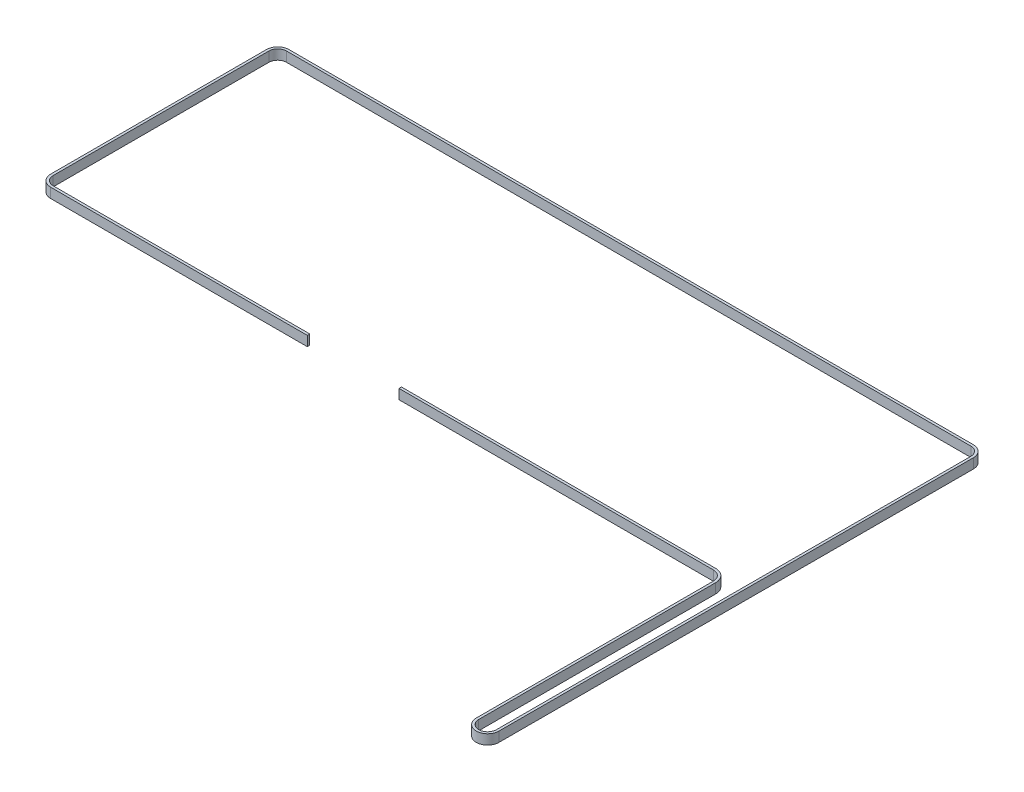
ISO-10303-21;
HEADER;
FILE_DESCRIPTION(('STEP AP214'),'2;1');
FILE_NAME('part.step','',(''),(''),'','','');
FILE_SCHEMA(('AUTOMOTIVE_DESIGN { 1 0 10303 214 1 1 1 1 }'));
ENDSEC;
DATA;
#1=APPLICATION_CONTEXT('core data for automotive mechanical design processes');
#2=APPLICATION_PROTOCOL_DEFINITION('international standard','automotive_design',2000,#1);
#3=PRODUCT_CONTEXT('',#1,'mechanical');
#4=PRODUCT('Part','Part','',(#3));
#5=PRODUCT_RELATED_PRODUCT_CATEGORY('part','',(#4));
#6=PRODUCT_DEFINITION_FORMATION('','',#4);
#7=PRODUCT_DEFINITION_CONTEXT('part definition',#1,'design');
#8=PRODUCT_DEFINITION('design','',#6,#7);
#9=PRODUCT_DEFINITION_SHAPE('','',#8);
#10=(LENGTH_UNIT() NAMED_UNIT(*) SI_UNIT(.MILLI.,.METRE.));
#11=(NAMED_UNIT(*) PLANE_ANGLE_UNIT() SI_UNIT($,.RADIAN.));
#12=(NAMED_UNIT(*) SI_UNIT($,.STERADIAN.) SOLID_ANGLE_UNIT());
#13=UNCERTAINTY_MEASURE_WITH_UNIT(LENGTH_MEASURE(1.E-05),#10,'distance_accuracy_value','');
#14=(GEOMETRIC_REPRESENTATION_CONTEXT(3) GLOBAL_UNCERTAINTY_ASSIGNED_CONTEXT((#13)) GLOBAL_UNIT_ASSIGNED_CONTEXT((#10,
#11,#12)) REPRESENTATION_CONTEXT('',''));
#15=CARTESIAN_POINT('',(0.,0.,0.));
#16=DIRECTION('',(0.,0.,1.));
#17=DIRECTION('',(1.,0.,0.));
#18=AXIS2_PLACEMENT_3D('',#15,#16,#17);
#19=CARTESIAN_POINT('',(195.6,315.,-15.5073370108978));
#20=DIRECTION('',(0.,1.,0.));
#21=DIRECTION('',(0.,0.,1.));
#22=AXIS2_PLACEMENT_3D('',#19,#20,#21);
#23=CYLINDRICAL_SURFACE('',#22,7.5);
#24=CARTESIAN_POINT('',(195.6,321.,-15.5073370108978));
#25=DIRECTION('',(0.,1.,0.));
#26=DIRECTION('',(0.,0.,1.));
#27=AXIS2_PLACEMENT_3D('',#24,#25,#26);
#28=CIRCLE('',#27,7.5);
#29=CARTESIAN_POINT('',(203.1,321.,-15.5073370108978));
#30=VERTEX_POINT('',#29);
#31=CARTESIAN_POINT('',(195.6,321.,-23.0073370108978));
#32=VERTEX_POINT('',#31);
#33=EDGE_CURVE('E230',#30,#32,#28,.T.);
#34=ORIENTED_EDGE('',*,*,#33,.F.);
#35=DIRECTION('',(0.,1.,0.));
#36=VECTOR('',#35,1.);
#37=CARTESIAN_POINT('',(203.1,315.,-15.5073370108978));
#38=LINE('',#37,#36);
#39=CARTESIAN_POINT('',(203.1,315.,-15.5073370108978));
#40=VERTEX_POINT('',#39);
#41=EDGE_CURVE('E11',#40,#30,#38,.T.);
#42=ORIENTED_EDGE('',*,*,#41,.F.);
#43=CARTESIAN_POINT('',(195.6,315.,-15.5073370108978));
#44=DIRECTION('',(0.,1.,0.));
#45=DIRECTION('',(0.,0.,1.));
#46=AXIS2_PLACEMENT_3D('',#43,#44,#45);
#47=CIRCLE('',#46,7.5);
#48=CARTESIAN_POINT('',(195.6,315.,-23.0073370108978));
#49=VERTEX_POINT('',#48);
#50=EDGE_CURVE('E298',#40,#49,#47,.T.);
#51=ORIENTED_EDGE('',*,*,#50,.T.);
#52=DIRECTION('',(0.,1.,0.));
#53=VECTOR('',#52,1.);
#54=CARTESIAN_POINT('',(195.6,315.,-23.0073370108978));
#55=LINE('',#54,#53);
#56=EDGE_CURVE('E40',#49,#32,#55,.T.);
#57=ORIENTED_EDGE('',*,*,#56,.T.);
#58=EDGE_LOOP('',(#34,#42,#51,#57));
#59=FACE_BOUND('',#58,.T.);
#60=ADVANCED_FACE('F37',(#59),#23,.T.);
#61=CARTESIAN_POINT('',(203.1,315.,129.));
#62=DIRECTION('',(1.,0.,0.));
#63=DIRECTION('',(0.,0.,-1.));
#64=AXIS2_PLACEMENT_3D('',#61,#62,#63);
#65=PLANE('',#64);
#66=DIRECTION('',(0.,0.,-1.));
#67=VECTOR('',#66,1.);
#68=CARTESIAN_POINT('',(203.1,321.,129.));
#69=LINE('',#68,#67);
#70=CARTESIAN_POINT('',(203.1,321.,129.));
#71=VERTEX_POINT('',#70);
#72=EDGE_CURVE('E296',#71,#30,#69,.T.);
#73=ORIENTED_EDGE('',*,*,#72,.F.);
#74=DIRECTION('',(0.,1.,0.));
#75=VECTOR('',#74,1.);
#76=CARTESIAN_POINT('',(203.1,315.,129.));
#77=LINE('',#76,#75);
#78=CARTESIAN_POINT('',(203.1,315.,129.));
#79=VERTEX_POINT('',#78);
#80=EDGE_CURVE('E46',#79,#71,#77,.T.);
#81=ORIENTED_EDGE('',*,*,#80,.F.);
#82=DIRECTION('',(0.,0.,-1.));
#83=VECTOR('',#82,1.);
#84=CARTESIAN_POINT('',(203.1,315.,129.));
#85=LINE('',#84,#83);
#86=EDGE_CURVE('E220',#79,#40,#85,.T.);
#87=ORIENTED_EDGE('',*,*,#86,.T.);
#88=ORIENTED_EDGE('',*,*,#41,.T.);
#89=EDGE_LOOP('',(#73,#81,#87,#88));
#90=FACE_BOUND('',#89,.T.);
#91=ADVANCED_FACE('F342',(#90),#65,.T.);
#92=CARTESIAN_POINT('',(208.5,315.,129.));
#93=DIRECTION('',(0.,1.,0.));
#94=DIRECTION('',(0.,0.,1.));
#95=AXIS2_PLACEMENT_3D('',#92,#93,#94);
#96=CYLINDRICAL_SURFACE('',#95,5.40000000000004);
#97=CARTESIAN_POINT('',(208.5,321.,129.));
#98=DIRECTION('',(0.,-1.,0.));
#99=DIRECTION('',(0.,0.,-1.));
#100=AXIS2_PLACEMENT_3D('',#97,#98,#99);
#101=CIRCLE('',#100,5.40000000000004);
#102=CARTESIAN_POINT('',(213.899997090555,321.,129.005605533312));
#103=VERTEX_POINT('',#102);
#104=EDGE_CURVE('E207',#103,#71,#101,.T.);
#105=ORIENTED_EDGE('',*,*,#104,.F.);
#106=DIRECTION('',(0.,1.,0.));
#107=VECTOR('',#106,1.);
#108=CARTESIAN_POINT('',(213.899997090555,315.,129.005605533312));
#109=LINE('',#108,#107);
#110=CARTESIAN_POINT('',(213.899997090555,315.,129.005605533312));
#111=VERTEX_POINT('',#110);
#112=EDGE_CURVE('E202',#111,#103,#109,.T.);
#113=ORIENTED_EDGE('',*,*,#112,.F.);
#114=CARTESIAN_POINT('',(208.5,315.,129.));
#115=DIRECTION('',(0.,-1.,0.));
#116=DIRECTION('',(0.,0.,-1.));
#117=AXIS2_PLACEMENT_3D('',#114,#115,#116);
#118=CIRCLE('',#117,5.40000000000004);
#119=EDGE_CURVE('E205',#111,#79,#118,.T.);
#120=ORIENTED_EDGE('',*,*,#119,.T.);
#121=ORIENTED_EDGE('',*,*,#80,.T.);
#122=EDGE_LOOP('',(#105,#113,#120,#121));
#123=FACE_BOUND('',#122,.T.);
#124=ADVANCED_FACE('F204',(#123),#96,.F.);
#125=CARTESIAN_POINT('',(214.199997090555,315.,-159.994394466687));
#126=DIRECTION('',(-0.999999461213783,0.,-0.00103806172444336));
#127=DIRECTION('',(-0.00103806172444336,0.,0.999999461213783));
#128=AXIS2_PLACEMENT_3D('',#125,#126,#127);
#129=PLANE('',#128);
#130=DIRECTION('',(-0.00103806172444336,0.,0.999999461213783));
#131=VECTOR('',#130,1.);
#132=CARTESIAN_POINT('',(214.199997090555,321.,-159.994394466687));
#133=LINE('',#132,#131);
#134=CARTESIAN_POINT('',(214.199997090554,321.,-159.994394466687));
#135=VERTEX_POINT('',#134);
#136=EDGE_CURVE('E293',#135,#103,#133,.T.);
#137=ORIENTED_EDGE('',*,*,#136,.F.);
#138=DIRECTION('',(0.,1.,0.));
#139=VECTOR('',#138,1.);
#140=CARTESIAN_POINT('',(214.199997090554,315.,-159.994394466687));
#141=LINE('',#140,#139);
#142=CARTESIAN_POINT('',(214.199997090554,315.,-159.994394466687));
#143=VERTEX_POINT('',#142);
#144=EDGE_CURVE('E212',#143,#135,#141,.T.);
#145=ORIENTED_EDGE('',*,*,#144,.F.);
#146=DIRECTION('',(-0.00103806172444336,0.,0.999999461213783));
#147=VECTOR('',#146,1.);
#148=CARTESIAN_POINT('',(214.199997090555,315.,-159.994394466687));
#149=LINE('',#148,#147);
#150=EDGE_CURVE('E218',#143,#111,#149,.T.);
#151=ORIENTED_EDGE('',*,*,#150,.T.);
#152=ORIENTED_EDGE('',*,*,#112,.T.);
#153=EDGE_LOOP('',(#137,#145,#151,#152));
#154=FACE_BOUND('',#153,.T.);
#155=ADVANCED_FACE('F222',(#154),#129,.T.);
#156=CARTESIAN_POINT('',(208.8,315.,-160.));
#157=DIRECTION('',(0.,1.,0.));
#158=DIRECTION('',(0.,0.,1.));
#159=AXIS2_PLACEMENT_3D('',#156,#157,#158);
#160=CYLINDRICAL_SURFACE('',#159,5.40000000000003);
#161=CARTESIAN_POINT('',(208.8,321.,-160.));
#162=DIRECTION('',(0.,-1.,0.));
#163=DIRECTION('',(0.,0.,-1.));
#164=AXIS2_PLACEMENT_3D('',#161,#162,#163);
#165=CIRCLE('',#164,5.40000000000003);
#166=CARTESIAN_POINT('',(208.8,321.,-165.4));
#167=VERTEX_POINT('',#166);
#168=EDGE_CURVE('E290',#167,#135,#165,.T.);
#169=ORIENTED_EDGE('',*,*,#168,.F.);
#170=DIRECTION('',(0.,1.,0.));
#171=VECTOR('',#170,1.);
#172=CARTESIAN_POINT('',(208.8,315.,-165.4));
#173=LINE('',#172,#171);
#174=CARTESIAN_POINT('',(208.8,315.,-165.4));
#175=VERTEX_POINT('',#174);
#176=EDGE_CURVE('E302',#175,#167,#173,.T.);
#177=ORIENTED_EDGE('',*,*,#176,.F.);
#178=CARTESIAN_POINT('',(208.8,315.,-160.));
#179=DIRECTION('',(0.,-1.,0.));
#180=DIRECTION('',(0.,0.,-1.));
#181=AXIS2_PLACEMENT_3D('',#178,#179,#180);
#182=CIRCLE('',#181,5.40000000000003);
#183=EDGE_CURVE('E223',#175,#143,#182,.T.);
#184=ORIENTED_EDGE('',*,*,#183,.T.);
#185=ORIENTED_EDGE('',*,*,#144,.T.);
#186=EDGE_LOOP('',(#169,#177,#184,#185));
#187=FACE_BOUND('',#186,.T.);
#188=ADVANCED_FACE('F355',(#187),#160,.F.);
#189=CARTESIAN_POINT('',(-208.5,315.,-165.4));
#190=DIRECTION('',(0.,0.,1.));
#191=DIRECTION('',(1.,0.,0.));
#192=AXIS2_PLACEMENT_3D('',#189,#190,#191);
#193=PLANE('',#192);
#194=DIRECTION('',(1.,0.,0.));
#195=VECTOR('',#194,1.);
#196=CARTESIAN_POINT('',(-208.5,321.,-165.4));
#197=LINE('',#196,#195);
#198=CARTESIAN_POINT('',(-208.5,321.,-165.4));
#199=VERTEX_POINT('',#198);
#200=EDGE_CURVE('E287',#199,#167,#197,.T.);
#201=ORIENTED_EDGE('',*,*,#200,.F.);
#202=DIRECTION('',(0.,1.,0.));
#203=VECTOR('',#202,1.);
#204=CARTESIAN_POINT('',(-208.5,315.,-165.4));
#205=LINE('',#204,#203);
#206=CARTESIAN_POINT('',(-208.5,315.,-165.4));
#207=VERTEX_POINT('',#206);
#208=EDGE_CURVE('E304',#207,#199,#205,.T.);
#209=ORIENTED_EDGE('',*,*,#208,.F.);
#210=DIRECTION('',(1.,0.,0.));
#211=VECTOR('',#210,1.);
#212=CARTESIAN_POINT('',(-208.5,315.,-165.4));
#213=LINE('',#212,#211);
#214=EDGE_CURVE('E225',#207,#175,#213,.T.);
#215=ORIENTED_EDGE('',*,*,#214,.T.);
#216=ORIENTED_EDGE('',*,*,#176,.T.);
#217=EDGE_LOOP('',(#201,#209,#215,#216));
#218=FACE_BOUND('',#217,.T.);
#219=ADVANCED_FACE('F358',(#218),#193,.T.);
#220=CARTESIAN_POINT('',(-208.5,315.,-160.));
#221=DIRECTION('',(0.,1.,0.));
#222=DIRECTION('',(0.,0.,1.));
#223=AXIS2_PLACEMENT_3D('',#220,#221,#222);
#224=CYLINDRICAL_SURFACE('',#223,5.4);
#225=CARTESIAN_POINT('',(-208.5,321.,-160.));
#226=DIRECTION('',(0.,-1.,0.));
#227=DIRECTION('',(0.,0.,-1.));
#228=AXIS2_PLACEMENT_3D('',#225,#226,#227);
#229=CIRCLE('',#228,5.4);
#230=CARTESIAN_POINT('',(-213.9,321.,-160.));
#231=VERTEX_POINT('',#230);
#232=EDGE_CURVE('E284',#231,#199,#229,.T.);
#233=ORIENTED_EDGE('',*,*,#232,.F.);
#234=DIRECTION('',(0.,1.,0.));
#235=VECTOR('',#234,1.);
#236=CARTESIAN_POINT('',(-213.9,315.,-160.));
#237=LINE('',#236,#235);
#238=CARTESIAN_POINT('',(-213.9,315.,-160.));
#239=VERTEX_POINT('',#238);
#240=EDGE_CURVE('E306',#239,#231,#237,.T.);
#241=ORIENTED_EDGE('',*,*,#240,.F.);
#242=CARTESIAN_POINT('',(-208.5,315.,-160.));
#243=DIRECTION('',(0.,-1.,0.));
#244=DIRECTION('',(0.,0.,-1.));
#245=AXIS2_PLACEMENT_3D('',#242,#243,#244);
#246=CIRCLE('',#245,5.4);
#247=EDGE_CURVE('E648',#239,#207,#246,.T.);
#248=ORIENTED_EDGE('',*,*,#247,.T.);
#249=ORIENTED_EDGE('',*,*,#208,.T.);
#250=EDGE_LOOP('',(#233,#241,#248,#249));
#251=FACE_BOUND('',#250,.T.);
#252=ADVANCED_FACE('F362',(#251),#224,.F.);
#253=CARTESIAN_POINT('',(-213.9,315.,-28.4573370108978));
#254=DIRECTION('',(1.,0.,0.));
#255=DIRECTION('',(0.,0.,-1.));
#256=AXIS2_PLACEMENT_3D('',#253,#254,#255);
#257=PLANE('',#256);
#258=DIRECTION('',(0.,0.,-1.));
#259=VECTOR('',#258,1.);
#260=CARTESIAN_POINT('',(-213.9,321.,-28.4573370108978));
#261=LINE('',#260,#259);
#262=CARTESIAN_POINT('',(-213.9,321.,-28.4573370108978));
#263=VERTEX_POINT('',#262);
#264=EDGE_CURVE('E281',#263,#231,#261,.T.);
#265=ORIENTED_EDGE('',*,*,#264,.F.);
#266=DIRECTION('',(0.,1.,0.));
#267=VECTOR('',#266,1.);
#268=CARTESIAN_POINT('',(-213.9,315.,-28.4573370108978));
#269=LINE('',#268,#267);
#270=CARTESIAN_POINT('',(-213.9,315.,-28.4573370108978));
#271=VERTEX_POINT('',#270);
#272=EDGE_CURVE('E308',#271,#263,#269,.T.);
#273=ORIENTED_EDGE('',*,*,#272,.F.);
#274=DIRECTION('',(0.,0.,-1.));
#275=VECTOR('',#274,1.);
#276=CARTESIAN_POINT('',(-213.9,315.,-28.4573370108978));
#277=LINE('',#276,#275);
#278=EDGE_CURVE('E652',#271,#239,#277,.T.);
#279=ORIENTED_EDGE('',*,*,#278,.T.);
#280=ORIENTED_EDGE('',*,*,#240,.T.);
#281=EDGE_LOOP('',(#265,#273,#279,#280));
#282=FACE_BOUND('',#281,.T.);
#283=ADVANCED_FACE('F366',(#282),#257,.T.);
#284=CARTESIAN_POINT('',(-208.5,315.,-28.4573370108978));
#285=DIRECTION('',(0.,1.,0.));
#286=DIRECTION('',(0.,0.,1.));
#287=AXIS2_PLACEMENT_3D('',#284,#285,#286);
#288=CYLINDRICAL_SURFACE('',#287,5.40000000000001);
#289=CARTESIAN_POINT('',(-208.5,321.,-28.4573370108978));
#290=DIRECTION('',(0.,-1.,0.));
#291=DIRECTION('',(0.,0.,-1.));
#292=AXIS2_PLACEMENT_3D('',#289,#290,#291);
#293=CIRCLE('',#292,5.40000000000001);
#294=CARTESIAN_POINT('',(-208.5,321.,-23.0573370108979));
#295=VERTEX_POINT('',#294);
#296=EDGE_CURVE('E278',#295,#263,#293,.T.);
#297=ORIENTED_EDGE('',*,*,#296,.F.);
#298=DIRECTION('',(0.,1.,0.));
#299=VECTOR('',#298,1.);
#300=CARTESIAN_POINT('',(-208.5,315.,-23.0573370108979));
#301=LINE('',#300,#299);
#302=CARTESIAN_POINT('',(-208.5,315.,-23.0573370108979));
#303=VERTEX_POINT('',#302);
#304=EDGE_CURVE('E310',#303,#295,#301,.T.);
#305=ORIENTED_EDGE('',*,*,#304,.F.);
#306=CARTESIAN_POINT('',(-208.5,315.,-28.4573370108978));
#307=DIRECTION('',(0.,-1.,0.));
#308=DIRECTION('',(0.,0.,-1.));
#309=AXIS2_PLACEMENT_3D('',#306,#307,#308);
#310=CIRCLE('',#309,5.40000000000001);
#311=EDGE_CURVE('E641',#303,#271,#310,.T.);
#312=ORIENTED_EDGE('',*,*,#311,.T.);
#313=ORIENTED_EDGE('',*,*,#272,.T.);
#314=EDGE_LOOP('',(#297,#305,#312,#313));
#315=FACE_BOUND('',#314,.T.);
#316=ADVANCED_FACE('F370',(#315),#288,.F.);
#317=CARTESIAN_POINT('',(-52.025054895684,315.,-23.0573370108979));
#318=DIRECTION('',(0.,0.,-1.));
#319=DIRECTION('',(-1.,0.,0.));
#320=AXIS2_PLACEMENT_3D('',#317,#318,#319);
#321=PLANE('',#320);
#322=DIRECTION('',(-1.,0.,0.));
#323=VECTOR('',#322,1.);
#324=CARTESIAN_POINT('',(-52.025054895684,321.,-23.0573370108979));
#325=LINE('',#324,#323);
#326=CARTESIAN_POINT('',(-52.025054895684,321.,-23.0573370108979));
#327=VERTEX_POINT('',#326);
#328=EDGE_CURVE('E275',#327,#295,#325,.T.);
#329=ORIENTED_EDGE('',*,*,#328,.F.);
#330=DIRECTION('',(0.,1.,0.));
#331=VECTOR('',#330,1.);
#332=CARTESIAN_POINT('',(-52.025054895684,315.,-23.0573370108979));
#333=LINE('',#332,#331);
#334=CARTESIAN_POINT('',(-52.025054895684,315.,-23.0573370108979));
#335=VERTEX_POINT('',#334);
#336=EDGE_CURVE('E312',#335,#327,#333,.T.);
#337=ORIENTED_EDGE('',*,*,#336,.F.);
#338=DIRECTION('',(-1.,0.,0.));
#339=VECTOR('',#338,1.);
#340=CARTESIAN_POINT('',(-52.025054895684,315.,-23.0573370108979));
#341=LINE('',#340,#339);
#342=EDGE_CURVE('E637',#335,#303,#341,.T.);
#343=ORIENTED_EDGE('',*,*,#342,.T.);
#344=ORIENTED_EDGE('',*,*,#304,.T.);
#345=EDGE_LOOP('',(#329,#337,#343,#344));
#346=FACE_BOUND('',#345,.T.);
#347=ADVANCED_FACE('F374',(#346),#321,.T.);
#348=CARTESIAN_POINT('',(-52.025054895684,315.,-21.5573370108978));
#349=DIRECTION('',(1.,0.,0.));
#350=DIRECTION('',(0.,0.,-1.));
#351=AXIS2_PLACEMENT_3D('',#348,#349,#350);
#352=PLANE('',#351);
#353=DIRECTION('',(0.,0.,-1.));
#354=VECTOR('',#353,1.);
#355=CARTESIAN_POINT('',(-52.025054895684,321.,-21.5573370108978));
#356=LINE('',#355,#354);
#357=CARTESIAN_POINT('',(-52.025054895684,321.,-21.5573370108978));
#358=VERTEX_POINT('',#357);
#359=EDGE_CURVE('E272',#358,#327,#356,.T.);
#360=ORIENTED_EDGE('',*,*,#359,.F.);
#361=DIRECTION('',(0.,1.,0.));
#362=VECTOR('',#361,1.);
#363=CARTESIAN_POINT('',(-52.025054895684,315.,-21.5573370108978));
#364=LINE('',#363,#362);
#365=CARTESIAN_POINT('',(-52.025054895684,315.,-21.5573370108978));
#366=VERTEX_POINT('',#365);
#367=EDGE_CURVE('E314',#366,#358,#364,.T.);
#368=ORIENTED_EDGE('',*,*,#367,.F.);
#369=DIRECTION('',(0.,0.,-1.));
#370=VECTOR('',#369,1.);
#371=CARTESIAN_POINT('',(-52.025054895684,315.,-21.5573370108978));
#372=LINE('',#371,#370);
#373=EDGE_CURVE('E658',#366,#335,#372,.T.);
#374=ORIENTED_EDGE('',*,*,#373,.T.);
#375=ORIENTED_EDGE('',*,*,#336,.T.);
#376=EDGE_LOOP('',(#360,#368,#374,#375));
#377=FACE_BOUND('',#376,.T.);
#378=ADVANCED_FACE('F378',(#377),#352,.T.);
#379=CARTESIAN_POINT('',(-208.5,315.,-21.5573370108978));
#380=DIRECTION('',(0.,0.,1.));
#381=DIRECTION('',(1.,0.,0.));
#382=AXIS2_PLACEMENT_3D('',#379,#380,#381);
#383=PLANE('',#382);
#384=DIRECTION('',(1.,0.,0.));
#385=VECTOR('',#384,1.);
#386=CARTESIAN_POINT('',(-208.5,321.,-21.5573370108978));
#387=LINE('',#386,#385);
#388=CARTESIAN_POINT('',(-208.5,321.,-21.5573370108978));
#389=VERTEX_POINT('',#388);
#390=EDGE_CURVE('E269',#389,#358,#387,.T.);
#391=ORIENTED_EDGE('',*,*,#390,.F.);
#392=DIRECTION('',(0.,1.,0.));
#393=VECTOR('',#392,1.);
#394=CARTESIAN_POINT('',(-208.5,315.,-21.5573370108978));
#395=LINE('',#394,#393);
#396=CARTESIAN_POINT('',(-208.5,315.,-21.5573370108978));
#397=VERTEX_POINT('',#396);
#398=EDGE_CURVE('E316',#397,#389,#395,.T.);
#399=ORIENTED_EDGE('',*,*,#398,.F.);
#400=DIRECTION('',(1.,0.,0.));
#401=VECTOR('',#400,1.);
#402=CARTESIAN_POINT('',(-208.5,315.,-21.5573370108978));
#403=LINE('',#402,#401);
#404=EDGE_CURVE('E630',#397,#366,#403,.T.);
#405=ORIENTED_EDGE('',*,*,#404,.T.);
#406=ORIENTED_EDGE('',*,*,#367,.T.);
#407=EDGE_LOOP('',(#391,#399,#405,#406));
#408=FACE_BOUND('',#407,.T.);
#409=ADVANCED_FACE('F382',(#408),#383,.T.);
#410=CARTESIAN_POINT('',(-208.5,315.,-28.4573370108978));
#411=DIRECTION('',(0.,1.,0.));
#412=DIRECTION('',(0.,0.,1.));
#413=AXIS2_PLACEMENT_3D('',#410,#411,#412);
#414=CYLINDRICAL_SURFACE('',#413,6.90000000000001);
#415=CARTESIAN_POINT('',(-208.5,321.,-28.4573370108978));
#416=DIRECTION('',(0.,1.,0.));
#417=DIRECTION('',(0.,0.,1.));
#418=AXIS2_PLACEMENT_3D('',#415,#416,#417);
#419=CIRCLE('',#418,6.90000000000001);
#420=CARTESIAN_POINT('',(-215.4,321.,-28.4573370108978));
#421=VERTEX_POINT('',#420);
#422=EDGE_CURVE('E266',#421,#389,#419,.T.);
#423=ORIENTED_EDGE('',*,*,#422,.F.);
#424=DIRECTION('',(0.,1.,0.));
#425=VECTOR('',#424,1.);
#426=CARTESIAN_POINT('',(-215.4,315.,-28.4573370108978));
#427=LINE('',#426,#425);
#428=CARTESIAN_POINT('',(-215.4,315.,-28.4573370108978));
#429=VERTEX_POINT('',#428);
#430=EDGE_CURVE('E318',#429,#421,#427,.T.);
#431=ORIENTED_EDGE('',*,*,#430,.F.);
#432=CARTESIAN_POINT('',(-208.5,315.,-28.4573370108978));
#433=DIRECTION('',(0.,1.,0.));
#434=DIRECTION('',(0.,0.,1.));
#435=AXIS2_PLACEMENT_3D('',#432,#433,#434);
#436=CIRCLE('',#435,6.90000000000001);
#437=EDGE_CURVE('E626',#429,#397,#436,.T.);
#438=ORIENTED_EDGE('',*,*,#437,.T.);
#439=ORIENTED_EDGE('',*,*,#398,.T.);
#440=EDGE_LOOP('',(#423,#431,#438,#439));
#441=FACE_BOUND('',#440,.T.);
#442=ADVANCED_FACE('F386',(#441),#414,.T.);
#443=CARTESIAN_POINT('',(-215.4,315.,-160.));
#444=DIRECTION('',(-1.,0.,0.));
#445=DIRECTION('',(0.,0.,1.));
#446=AXIS2_PLACEMENT_3D('',#443,#444,#445);
#447=PLANE('',#446);
#448=DIRECTION('',(0.,0.,1.));
#449=VECTOR('',#448,1.);
#450=CARTESIAN_POINT('',(-215.4,321.,-160.));
#451=LINE('',#450,#449);
#452=CARTESIAN_POINT('',(-215.4,321.,-160.));
#453=VERTEX_POINT('',#452);
#454=EDGE_CURVE('E263',#453,#421,#451,.T.);
#455=ORIENTED_EDGE('',*,*,#454,.F.);
#456=DIRECTION('',(0.,1.,0.));
#457=VECTOR('',#456,1.);
#458=CARTESIAN_POINT('',(-215.4,315.,-160.));
#459=LINE('',#458,#457);
#460=CARTESIAN_POINT('',(-215.4,315.,-160.));
#461=VERTEX_POINT('',#460);
#462=EDGE_CURVE('E320',#461,#453,#459,.T.);
#463=ORIENTED_EDGE('',*,*,#462,.F.);
#464=DIRECTION('',(0.,0.,1.));
#465=VECTOR('',#464,1.);
#466=CARTESIAN_POINT('',(-215.4,315.,-160.));
#467=LINE('',#466,#465);
#468=EDGE_CURVE('E662',#461,#429,#467,.T.);
#469=ORIENTED_EDGE('',*,*,#468,.T.);
#470=ORIENTED_EDGE('',*,*,#430,.T.);
#471=EDGE_LOOP('',(#455,#463,#469,#470));
#472=FACE_BOUND('',#471,.T.);
#473=ADVANCED_FACE('F390',(#472),#447,.T.);
#474=CARTESIAN_POINT('',(-208.5,315.,-160.));
#475=DIRECTION('',(0.,1.,0.));
#476=DIRECTION('',(0.,0.,1.));
#477=AXIS2_PLACEMENT_3D('',#474,#475,#476);
#478=CYLINDRICAL_SURFACE('',#477,6.9);
#479=CARTESIAN_POINT('',(-208.5,321.,-160.));
#480=DIRECTION('',(0.,1.,0.));
#481=DIRECTION('',(0.,0.,1.));
#482=AXIS2_PLACEMENT_3D('',#479,#480,#481);
#483=CIRCLE('',#482,6.9);
#484=CARTESIAN_POINT('',(-208.5,321.,-166.9));
#485=VERTEX_POINT('',#484);
#486=EDGE_CURVE('E260',#485,#453,#483,.T.);
#487=ORIENTED_EDGE('',*,*,#486,.F.);
#488=DIRECTION('',(0.,1.,0.));
#489=VECTOR('',#488,1.);
#490=CARTESIAN_POINT('',(-208.5,315.,-166.9));
#491=LINE('',#490,#489);
#492=CARTESIAN_POINT('',(-208.5,315.,-166.9));
#493=VERTEX_POINT('',#492);
#494=EDGE_CURVE('E322',#493,#485,#491,.T.);
#495=ORIENTED_EDGE('',*,*,#494,.F.);
#496=CARTESIAN_POINT('',(-208.5,315.,-160.));
#497=DIRECTION('',(0.,1.,0.));
#498=DIRECTION('',(0.,0.,1.));
#499=AXIS2_PLACEMENT_3D('',#496,#497,#498);
#500=CIRCLE('',#499,6.9);
#501=EDGE_CURVE('E619',#493,#461,#500,.T.);
#502=ORIENTED_EDGE('',*,*,#501,.T.);
#503=ORIENTED_EDGE('',*,*,#462,.T.);
#504=EDGE_LOOP('',(#487,#495,#502,#503));
#505=FACE_BOUND('',#504,.T.);
#506=ADVANCED_FACE('F394',(#505),#478,.T.);
#507=CARTESIAN_POINT('',(208.8,315.,-166.9));
#508=DIRECTION('',(0.,0.,-1.));
#509=DIRECTION('',(-1.,0.,0.));
#510=AXIS2_PLACEMENT_3D('',#507,#508,#509);
#511=PLANE('',#510);
#512=DIRECTION('',(-1.,0.,0.));
#513=VECTOR('',#512,1.);
#514=CARTESIAN_POINT('',(208.8,321.,-166.9));
#515=LINE('',#514,#513);
#516=CARTESIAN_POINT('',(208.8,321.,-166.9));
#517=VERTEX_POINT('',#516);
#518=EDGE_CURVE('E257',#517,#485,#515,.T.);
#519=ORIENTED_EDGE('',*,*,#518,.F.);
#520=DIRECTION('',(0.,1.,0.));
#521=VECTOR('',#520,1.);
#522=CARTESIAN_POINT('',(208.8,315.,-166.9));
#523=LINE('',#522,#521);
#524=CARTESIAN_POINT('',(208.8,315.,-166.9));
#525=VERTEX_POINT('',#524);
#526=EDGE_CURVE('E324',#525,#517,#523,.T.);
#527=ORIENTED_EDGE('',*,*,#526,.F.);
#528=DIRECTION('',(-1.,0.,0.));
#529=VECTOR('',#528,1.);
#530=CARTESIAN_POINT('',(208.8,315.,-166.9));
#531=LINE('',#530,#529);
#532=EDGE_CURVE('E615',#525,#493,#531,.T.);
#533=ORIENTED_EDGE('',*,*,#532,.T.);
#534=ORIENTED_EDGE('',*,*,#494,.T.);
#535=EDGE_LOOP('',(#519,#527,#533,#534));
#536=FACE_BOUND('',#535,.T.);
#537=ADVANCED_FACE('F398',(#536),#511,.T.);
#538=CARTESIAN_POINT('',(208.8,315.,-160.));
#539=DIRECTION('',(0.,1.,0.));
#540=DIRECTION('',(0.,0.,1.));
#541=AXIS2_PLACEMENT_3D('',#538,#539,#540);
#542=CYLINDRICAL_SURFACE('',#541,6.89999999999995);
#543=CARTESIAN_POINT('',(208.8,321.,-160.));
#544=DIRECTION('',(0.,1.,0.));
#545=DIRECTION('',(0.,0.,1.));
#546=AXIS2_PLACEMENT_3D('',#543,#544,#545);
#547=CIRCLE('',#546,6.89999999999995);
#548=CARTESIAN_POINT('',(215.699996282375,321.,-159.992837374101));
#549=VERTEX_POINT('',#548);
#550=EDGE_CURVE('E254',#549,#517,#547,.T.);
#551=ORIENTED_EDGE('',*,*,#550,.F.);
#552=DIRECTION('',(0.,1.,0.));
#553=VECTOR('',#552,1.);
#554=CARTESIAN_POINT('',(215.699996282375,315.,-159.992837374101));
#555=LINE('',#554,#553);
#556=CARTESIAN_POINT('',(215.699996282375,315.,-159.992837374101));
#557=VERTEX_POINT('',#556);
#558=EDGE_CURVE('E326',#557,#549,#555,.T.);
#559=ORIENTED_EDGE('',*,*,#558,.F.);
#560=CARTESIAN_POINT('',(208.8,315.,-160.));
#561=DIRECTION('',(0.,1.,0.));
#562=DIRECTION('',(0.,0.,1.));
#563=AXIS2_PLACEMENT_3D('',#560,#561,#562);
#564=CIRCLE('',#563,6.89999999999995);
#565=EDGE_CURVE('E666',#557,#525,#564,.T.);
#566=ORIENTED_EDGE('',*,*,#565,.T.);
#567=ORIENTED_EDGE('',*,*,#526,.T.);
#568=EDGE_LOOP('',(#551,#559,#566,#567));
#569=FACE_BOUND('',#568,.T.);
#570=ADVANCED_FACE('F402',(#569),#542,.T.);
#571=CARTESIAN_POINT('',(215.399996282375,315.,129.007162625899));
#572=DIRECTION('',(0.999999461213783,0.,0.00103806172444336));
#573=DIRECTION('',(0.00103806172444336,0.,-0.999999461213783));
#574=AXIS2_PLACEMENT_3D('',#571,#572,#573);
#575=PLANE('',#574);
#576=DIRECTION('',(0.00103806172444336,0.,-0.999999461213783));
#577=VECTOR('',#576,1.);
#578=CARTESIAN_POINT('',(215.399996282375,321.,129.007162625899));
#579=LINE('',#578,#577);
#580=CARTESIAN_POINT('',(215.399996282375,321.,129.007162625899));
#581=VERTEX_POINT('',#580);
#582=EDGE_CURVE('E251',#581,#549,#579,.T.);
#583=ORIENTED_EDGE('',*,*,#582,.F.);
#584=DIRECTION('',(0.,1.,0.));
#585=VECTOR('',#584,1.);
#586=CARTESIAN_POINT('',(215.399996282375,315.,129.007162625899));
#587=LINE('',#586,#585);
#588=CARTESIAN_POINT('',(215.399996282375,315.,129.007162625899));
#589=VERTEX_POINT('',#588);
#590=EDGE_CURVE('E328',#589,#581,#587,.T.);
#591=ORIENTED_EDGE('',*,*,#590,.F.);
#592=DIRECTION('',(0.00103806172444336,0.,-0.999999461213783));
#593=VECTOR('',#592,1.);
#594=CARTESIAN_POINT('',(215.399996282375,315.,129.007162625899));
#595=LINE('',#594,#593);
#596=EDGE_CURVE('E608',#589,#557,#595,.T.);
#597=ORIENTED_EDGE('',*,*,#596,.T.);
#598=ORIENTED_EDGE('',*,*,#558,.T.);
#599=EDGE_LOOP('',(#583,#591,#597,#598));
#600=FACE_BOUND('',#599,.T.);
#601=ADVANCED_FACE('F406',(#600),#575,.T.);
#602=CARTESIAN_POINT('',(208.5,315.,129.));
#603=DIRECTION('',(0.,1.,0.));
#604=DIRECTION('',(0.,0.,1.));
#605=AXIS2_PLACEMENT_3D('',#602,#603,#604);
#606=CYLINDRICAL_SURFACE('',#605,6.89999999999996);
#607=CARTESIAN_POINT('',(208.5,321.,129.));
#608=DIRECTION('',(0.,1.,0.));
#609=DIRECTION('',(0.,0.,1.));
#610=AXIS2_PLACEMENT_3D('',#607,#608,#609);
#611=CIRCLE('',#610,6.89999999999996);
#612=CARTESIAN_POINT('',(201.6,321.,129.));
#613=VERTEX_POINT('',#612);
#614=EDGE_CURVE('E248',#613,#581,#611,.T.);
#615=ORIENTED_EDGE('',*,*,#614,.F.);
#616=DIRECTION('',(0.,1.,0.));
#617=VECTOR('',#616,1.);
#618=CARTESIAN_POINT('',(201.6,315.,129.));
#619=LINE('',#618,#617);
#620=CARTESIAN_POINT('',(201.6,315.,129.));
#621=VERTEX_POINT('',#620);
#622=EDGE_CURVE('E330',#621,#613,#619,.T.);
#623=ORIENTED_EDGE('',*,*,#622,.F.);
#624=CARTESIAN_POINT('',(208.5,315.,129.));
#625=DIRECTION('',(0.,1.,0.));
#626=DIRECTION('',(0.,0.,1.));
#627=AXIS2_PLACEMENT_3D('',#624,#625,#626);
#628=CIRCLE('',#627,6.89999999999996);
#629=EDGE_CURVE('E604',#621,#589,#628,.T.);
#630=ORIENTED_EDGE('',*,*,#629,.T.);
#631=ORIENTED_EDGE('',*,*,#590,.T.);
#632=EDGE_LOOP('',(#615,#623,#630,#631));
#633=FACE_BOUND('',#632,.T.);
#634=ADVANCED_FACE('F410',(#633),#606,.T.);
#635=CARTESIAN_POINT('',(201.6,315.,-15.5073370108978));
#636=DIRECTION('',(-1.,0.,0.));
#637=DIRECTION('',(0.,0.,1.));
#638=AXIS2_PLACEMENT_3D('',#635,#636,#637);
#639=PLANE('',#638);
#640=DIRECTION('',(0.,0.,1.));
#641=VECTOR('',#640,1.);
#642=CARTESIAN_POINT('',(201.6,321.,-15.5073370108978));
#643=LINE('',#642,#641);
#644=CARTESIAN_POINT('',(201.6,321.,-15.5073370108978));
#645=VERTEX_POINT('',#644);
#646=EDGE_CURVE('E245',#645,#613,#643,.T.);
#647=ORIENTED_EDGE('',*,*,#646,.F.);
#648=DIRECTION('',(0.,1.,0.));
#649=VECTOR('',#648,1.);
#650=CARTESIAN_POINT('',(201.6,315.,-15.5073370108978));
#651=LINE('',#650,#649);
#652=CARTESIAN_POINT('',(201.6,315.,-15.5073370108978));
#653=VERTEX_POINT('',#652);
#654=EDGE_CURVE('E332',#653,#645,#651,.T.);
#655=ORIENTED_EDGE('',*,*,#654,.F.);
#656=DIRECTION('',(0.,0.,1.));
#657=VECTOR('',#656,1.);
#658=CARTESIAN_POINT('',(201.6,315.,-15.5073370108978));
#659=LINE('',#658,#657);
#660=EDGE_CURVE('E670',#653,#621,#659,.T.);
#661=ORIENTED_EDGE('',*,*,#660,.T.);
#662=ORIENTED_EDGE('',*,*,#622,.T.);
#663=EDGE_LOOP('',(#647,#655,#661,#662));
#664=FACE_BOUND('',#663,.T.);
#665=ADVANCED_FACE('F414',(#664),#639,.T.);
#666=CARTESIAN_POINT('',(195.6,315.,-15.5073370108978));
#667=DIRECTION('',(0.,1.,0.));
#668=DIRECTION('',(0.,0.,1.));
#669=AXIS2_PLACEMENT_3D('',#666,#667,#668);
#670=CYLINDRICAL_SURFACE('',#669,6.);
#671=CARTESIAN_POINT('',(195.6,321.,-15.5073370108978));
#672=DIRECTION('',(0.,-1.,0.));
#673=DIRECTION('',(0.,0.,-1.));
#674=AXIS2_PLACEMENT_3D('',#671,#672,#673);
#675=CIRCLE('',#674,6.);
#676=CARTESIAN_POINT('',(195.6,321.,-21.5073370108978));
#677=VERTEX_POINT('',#676);
#678=EDGE_CURVE('E242',#677,#645,#675,.T.);
#679=ORIENTED_EDGE('',*,*,#678,.F.);
#680=DIRECTION('',(0.,1.,0.));
#681=VECTOR('',#680,1.);
#682=CARTESIAN_POINT('',(195.6,315.,-21.5073370108978));
#683=LINE('',#682,#681);
#684=CARTESIAN_POINT('',(195.6,315.,-21.5073370108978));
#685=VERTEX_POINT('',#684);
#686=EDGE_CURVE('E334',#685,#677,#683,.T.);
#687=ORIENTED_EDGE('',*,*,#686,.F.);
#688=CARTESIAN_POINT('',(195.6,315.,-15.5073370108978));
#689=DIRECTION('',(0.,-1.,0.));
#690=DIRECTION('',(0.,0.,-1.));
#691=AXIS2_PLACEMENT_3D('',#688,#689,#690);
#692=CIRCLE('',#691,6.);
#693=EDGE_CURVE('E597',#685,#653,#692,.T.);
#694=ORIENTED_EDGE('',*,*,#693,.T.);
#695=ORIENTED_EDGE('',*,*,#654,.T.);
#696=EDGE_LOOP('',(#679,#687,#694,#695));
#697=FACE_BOUND('',#696,.T.);
#698=ADVANCED_FACE('F418',(#697),#670,.F.);
#699=CARTESIAN_POINT('',(3.97494510431601,315.,-21.5073370108978));
#700=DIRECTION('',(0.,0.,1.));
#701=DIRECTION('',(1.,0.,0.));
#702=AXIS2_PLACEMENT_3D('',#699,#700,#701);
#703=PLANE('',#702);
#704=DIRECTION('',(1.,0.,0.));
#705=VECTOR('',#704,1.);
#706=CARTESIAN_POINT('',(3.97494510431601,321.,-21.5073370108978));
#707=LINE('',#706,#705);
#708=CARTESIAN_POINT('',(3.97494510431601,321.,-21.5073370108978));
#709=VERTEX_POINT('',#708);
#710=EDGE_CURVE('E239',#709,#677,#707,.T.);
#711=ORIENTED_EDGE('',*,*,#710,.F.);
#712=DIRECTION('',(0.,1.,0.));
#713=VECTOR('',#712,1.);
#714=CARTESIAN_POINT('',(3.97494510431601,315.,-21.5073370108978));
#715=LINE('',#714,#713);
#716=CARTESIAN_POINT('',(3.97494510431601,315.,-21.5073370108978));
#717=VERTEX_POINT('',#716);
#718=EDGE_CURVE('E336',#717,#709,#715,.T.);
#719=ORIENTED_EDGE('',*,*,#718,.F.);
#720=DIRECTION('',(1.,0.,0.));
#721=VECTOR('',#720,1.);
#722=CARTESIAN_POINT('',(3.97494510431601,315.,-21.5073370108978));
#723=LINE('',#722,#721);
#724=EDGE_CURVE('E593',#717,#685,#723,.T.);
#725=ORIENTED_EDGE('',*,*,#724,.T.);
#726=ORIENTED_EDGE('',*,*,#686,.T.);
#727=EDGE_LOOP('',(#711,#719,#725,#726));
#728=FACE_BOUND('',#727,.T.);
#729=ADVANCED_FACE('F422',(#728),#703,.T.);
#730=CARTESIAN_POINT('',(3.97494510431601,315.,-23.0073370108978));
#731=DIRECTION('',(-1.,0.,0.));
#732=DIRECTION('',(0.,0.,1.));
#733=AXIS2_PLACEMENT_3D('',#730,#731,#732);
#734=PLANE('',#733);
#735=DIRECTION('',(0.,0.,1.));
#736=VECTOR('',#735,1.);
#737=CARTESIAN_POINT('',(3.97494510431601,321.,-23.0073370108978));
#738=LINE('',#737,#736);
#739=CARTESIAN_POINT('',(3.97494510431601,321.,-23.0073370108978));
#740=VERTEX_POINT('',#739);
#741=EDGE_CURVE('E236',#740,#709,#738,.T.);
#742=ORIENTED_EDGE('',*,*,#741,.F.);
#743=DIRECTION('',(0.,1.,0.));
#744=VECTOR('',#743,1.);
#745=CARTESIAN_POINT('',(3.97494510431601,315.,-23.0073370108978));
#746=LINE('',#745,#744);
#747=CARTESIAN_POINT('',(3.97494510431601,315.,-23.0073370108978));
#748=VERTEX_POINT('',#747);
#749=EDGE_CURVE('E337',#748,#740,#746,.T.);
#750=ORIENTED_EDGE('',*,*,#749,.F.);
#751=DIRECTION('',(0.,0.,1.));
#752=VECTOR('',#751,1.);
#753=CARTESIAN_POINT('',(3.97494510431601,315.,-23.0073370108978));
#754=LINE('',#753,#752);
#755=EDGE_CURVE('E674',#748,#717,#754,.T.);
#756=ORIENTED_EDGE('',*,*,#755,.T.);
#757=ORIENTED_EDGE('',*,*,#718,.T.);
#758=EDGE_LOOP('',(#742,#750,#756,#757));
#759=FACE_BOUND('',#758,.T.);
#760=ADVANCED_FACE('F426',(#759),#734,.T.);
#761=CARTESIAN_POINT('',(195.6,315.,-23.0073370108978));
#762=DIRECTION('',(0.,0.,-1.));
#763=DIRECTION('',(-1.,0.,0.));
#764=AXIS2_PLACEMENT_3D('',#761,#762,#763);
#765=PLANE('',#764);
#766=DIRECTION('',(-1.,0.,0.));
#767=VECTOR('',#766,1.);
#768=CARTESIAN_POINT('',(195.6,321.,-23.0073370108978));
#769=LINE('',#768,#767);
#770=EDGE_CURVE('E233',#32,#740,#769,.T.);
#771=ORIENTED_EDGE('',*,*,#770,.F.);
#772=ORIENTED_EDGE('',*,*,#56,.F.);
#773=DIRECTION('',(-1.,0.,0.));
#774=VECTOR('',#773,1.);
#775=CARTESIAN_POINT('',(195.6,315.,-23.0073370108978));
#776=LINE('',#775,#774);
#777=EDGE_CURVE('E676',#49,#748,#776,.T.);
#778=ORIENTED_EDGE('',*,*,#777,.T.);
#779=ORIENTED_EDGE('',*,*,#749,.T.);
#780=EDGE_LOOP('',(#771,#772,#778,#779));
#781=FACE_BOUND('',#780,.T.);
#782=ADVANCED_FACE('F339',(#781),#765,.T.);
#783=CARTESIAN_POINT('',(195.6,315.,-15.5073370108978));
#784=DIRECTION('',(0.,1.,0.));
#785=DIRECTION('',(0.,0.,1.));
#786=AXIS2_PLACEMENT_3D('',#783,#784,#785);
#787=PLANE('',#786);
#788=ORIENTED_EDGE('',*,*,#50,.F.);
#789=ORIENTED_EDGE('',*,*,#86,.F.);
#790=ORIENTED_EDGE('',*,*,#119,.F.);
#791=ORIENTED_EDGE('',*,*,#150,.F.);
#792=ORIENTED_EDGE('',*,*,#183,.F.);
#793=ORIENTED_EDGE('',*,*,#214,.F.);
#794=ORIENTED_EDGE('',*,*,#247,.F.);
#795=ORIENTED_EDGE('',*,*,#278,.F.);
#796=ORIENTED_EDGE('',*,*,#311,.F.);
#797=ORIENTED_EDGE('',*,*,#342,.F.);
#798=ORIENTED_EDGE('',*,*,#373,.F.);
#799=ORIENTED_EDGE('',*,*,#404,.F.);
#800=ORIENTED_EDGE('',*,*,#437,.F.);
#801=ORIENTED_EDGE('',*,*,#468,.F.);
#802=ORIENTED_EDGE('',*,*,#501,.F.);
#803=ORIENTED_EDGE('',*,*,#532,.F.);
#804=ORIENTED_EDGE('',*,*,#565,.F.);
#805=ORIENTED_EDGE('',*,*,#596,.F.);
#806=ORIENTED_EDGE('',*,*,#629,.F.);
#807=ORIENTED_EDGE('',*,*,#660,.F.);
#808=ORIENTED_EDGE('',*,*,#693,.F.);
#809=ORIENTED_EDGE('',*,*,#724,.F.);
#810=ORIENTED_EDGE('',*,*,#755,.F.);
#811=ORIENTED_EDGE('',*,*,#777,.F.);
#812=EDGE_LOOP('',(#788,#789,#790,#791,#792,#793,#794,#795,#796,#797,#798,#799,#800,#801,#802,
#803,#804,#805,#806,#807,#808,#809,#810,#811));
#813=FACE_BOUND('',#812,.T.);
#814=ADVANCED_FACE('F216',(#813),#787,.F.);
#815=CARTESIAN_POINT('',(195.6,321.,-15.5073370108978));
#816=DIRECTION('',(0.,1.,0.));
#817=DIRECTION('',(0.,0.,1.));
#818=AXIS2_PLACEMENT_3D('',#815,#816,#817);
#819=PLANE('',#818);
#820=ORIENTED_EDGE('',*,*,#33,.T.);
#821=ORIENTED_EDGE('',*,*,#770,.T.);
#822=ORIENTED_EDGE('',*,*,#741,.T.);
#823=ORIENTED_EDGE('',*,*,#710,.T.);
#824=ORIENTED_EDGE('',*,*,#678,.T.);
#825=ORIENTED_EDGE('',*,*,#646,.T.);
#826=ORIENTED_EDGE('',*,*,#614,.T.);
#827=ORIENTED_EDGE('',*,*,#582,.T.);
#828=ORIENTED_EDGE('',*,*,#550,.T.);
#829=ORIENTED_EDGE('',*,*,#518,.T.);
#830=ORIENTED_EDGE('',*,*,#486,.T.);
#831=ORIENTED_EDGE('',*,*,#454,.T.);
#832=ORIENTED_EDGE('',*,*,#422,.T.);
#833=ORIENTED_EDGE('',*,*,#390,.T.);
#834=ORIENTED_EDGE('',*,*,#359,.T.);
#835=ORIENTED_EDGE('',*,*,#328,.T.);
#836=ORIENTED_EDGE('',*,*,#296,.T.);
#837=ORIENTED_EDGE('',*,*,#264,.T.);
#838=ORIENTED_EDGE('',*,*,#232,.T.);
#839=ORIENTED_EDGE('',*,*,#200,.T.);
#840=ORIENTED_EDGE('',*,*,#168,.T.);
#841=ORIENTED_EDGE('',*,*,#136,.T.);
#842=ORIENTED_EDGE('',*,*,#104,.T.);
#843=ORIENTED_EDGE('',*,*,#72,.T.);
#844=EDGE_LOOP('',(#820,#821,#822,#823,#824,#825,#826,#827,#828,#829,#830,#831,#832,#833,#834,
#835,#836,#837,#838,#839,#840,#841,#842,#843));
#845=FACE_BOUND('',#844,.T.);
#846=ADVANCED_FACE('F341',(#845),#819,.T.);
#847=CLOSED_SHELL('',(#60,#91,#124,#155,#188,#219,#252,#283,#316,#347,#378,#409,#442,#473,#506,
#537,#570,#601,#634,#665,#698,#729,#760,#782,#814,#846));
#848=MANIFOLD_SOLID_BREP('B2',#847);
#849=ADVANCED_BREP_SHAPE_REPRESENTATION('',(#18,#848),#14);
#850=SHAPE_DEFINITION_REPRESENTATION(#9,#849);
ENDSEC;
END-ISO-10303-21;
